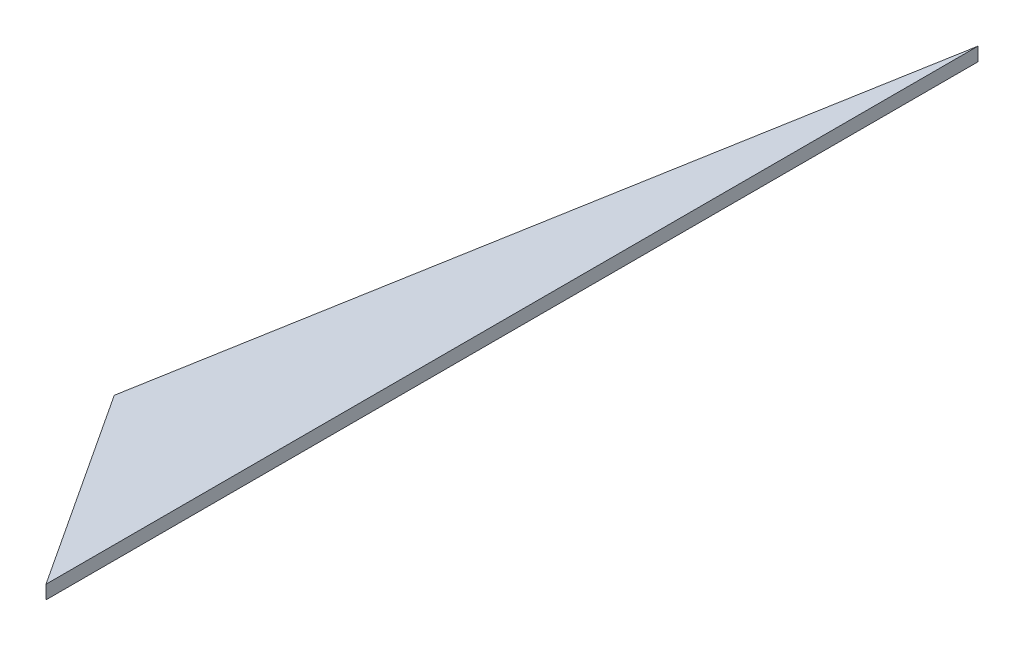
ISO-10303-21;
HEADER;
FILE_DESCRIPTION(('STEP AP214'),'2;1');
FILE_NAME('part.step','',(''),(''),'','','');
FILE_SCHEMA(('AUTOMOTIVE_DESIGN { 1 0 10303 214 1 1 1 1 }'));
ENDSEC;
DATA;
#1=APPLICATION_CONTEXT('core data for automotive mechanical design processes');
#2=APPLICATION_PROTOCOL_DEFINITION('international standard','automotive_design',2000,#1);
#3=PRODUCT_CONTEXT('',#1,'mechanical');
#4=PRODUCT('Part','Part','',(#3));
#5=PRODUCT_RELATED_PRODUCT_CATEGORY('part','',(#4));
#6=PRODUCT_DEFINITION_FORMATION('','',#4);
#7=PRODUCT_DEFINITION_CONTEXT('part definition',#1,'design');
#8=PRODUCT_DEFINITION('design','',#6,#7);
#9=PRODUCT_DEFINITION_SHAPE('','',#8);
#10=(LENGTH_UNIT() NAMED_UNIT(*) SI_UNIT(.MILLI.,.METRE.));
#11=(NAMED_UNIT(*) PLANE_ANGLE_UNIT() SI_UNIT($,.RADIAN.));
#12=(NAMED_UNIT(*) SI_UNIT($,.STERADIAN.) SOLID_ANGLE_UNIT());
#13=UNCERTAINTY_MEASURE_WITH_UNIT(LENGTH_MEASURE(1.E-05),#10,'distance_accuracy_value','');
#14=(GEOMETRIC_REPRESENTATION_CONTEXT(3) GLOBAL_UNCERTAINTY_ASSIGNED_CONTEXT((#13)) GLOBAL_UNIT_ASSIGNED_CONTEXT((#10,
#11,#12)) REPRESENTATION_CONTEXT('',''));
#15=CARTESIAN_POINT('',(0.,0.,0.));
#16=DIRECTION('',(0.,0.,1.));
#17=DIRECTION('',(1.,0.,0.));
#18=AXIS2_PLACEMENT_3D('',#15,#16,#17);
#19=CARTESIAN_POINT('',(-846.847432846052,88.9,-1293.28955011006));
#20=DIRECTION('',(0.836603496854691,0.,-0.54780889829438));
#21=DIRECTION('',(-0.54780889829438,0.,-0.836603496854691));
#22=AXIS2_PLACEMENT_3D('',#19,#20,#21);
#23=PLANE('',#22);
#24=DIRECTION('',(0.54780889829438,0.,0.836603496854691));
#25=VECTOR('',#24,1.);
#26=CARTESIAN_POINT('',(-846.847432846052,0.,-1293.28955011006));
#27=LINE('',#26,#25);
#28=CARTESIAN_POINT('',(-846.847432846052,0.,-1293.28955011006));
#29=VERTEX_POINT('',#28);
#30=CARTESIAN_POINT('',(0.,0.,0.));
#31=VERTEX_POINT('',#30);
#32=EDGE_CURVE('E89',#29,#31,#27,.T.);
#33=ORIENTED_EDGE('',*,*,#32,.T.);
#34=DIRECTION('',(0.,-1.,0.));
#35=VECTOR('',#34,1.);
#36=CARTESIAN_POINT('',(0.,88.9,0.));
#37=LINE('',#36,#35);
#38=CARTESIAN_POINT('',(0.,88.9,0.));
#39=VERTEX_POINT('',#38);
#40=EDGE_CURVE('E11',#39,#31,#37,.T.);
#41=ORIENTED_EDGE('',*,*,#40,.F.);
#42=DIRECTION('',(0.54780889829438,0.,0.836603496854691));
#43=VECTOR('',#42,1.);
#44=CARTESIAN_POINT('',(-846.847432846052,88.9,-1293.28955011006));
#45=LINE('',#44,#43);
#46=CARTESIAN_POINT('',(-846.847432846052,88.9,-1293.28955011006));
#47=VERTEX_POINT('',#46);
#48=EDGE_CURVE('E81',#47,#39,#45,.T.);
#49=ORIENTED_EDGE('',*,*,#48,.F.);
#50=DIRECTION('',(0.,-1.,0.));
#51=VECTOR('',#50,1.);
#52=CARTESIAN_POINT('',(-846.847432846052,88.9,-1293.28955011006));
#53=LINE('',#52,#51);
#54=EDGE_CURVE('E90',#47,#29,#53,.T.);
#55=ORIENTED_EDGE('',*,*,#54,.T.);
#56=EDGE_LOOP('',(#33,#41,#49,#55));
#57=FACE_BOUND('',#56,.T.);
#58=ADVANCED_FACE('F39',(#57),#23,.F.);
#59=CARTESIAN_POINT('',(0.,88.9,0.));
#60=DIRECTION('',(-1.,0.,0.));
#61=DIRECTION('',(0.,0.,1.));
#62=AXIS2_PLACEMENT_3D('',#59,#60,#61);
#63=PLANE('',#62);
#64=DIRECTION('',(0.,0.,-1.));
#65=VECTOR('',#64,1.);
#66=CARTESIAN_POINT('',(0.,0.,0.));
#67=LINE('',#66,#65);
#68=CARTESIAN_POINT('',(0.,0.,-6096.));
#69=VERTEX_POINT('',#68);
#70=EDGE_CURVE('E68',#31,#69,#67,.T.);
#71=ORIENTED_EDGE('',*,*,#70,.T.);
#72=DIRECTION('',(0.,-1.,0.));
#73=VECTOR('',#72,1.);
#74=CARTESIAN_POINT('',(0.,88.9,-6096.));
#75=LINE('',#74,#73);
#76=CARTESIAN_POINT('',(0.,88.9,-6096.));
#77=VERTEX_POINT('',#76);
#78=EDGE_CURVE('E48',#77,#69,#75,.T.);
#79=ORIENTED_EDGE('',*,*,#78,.F.);
#80=DIRECTION('',(0.,0.,-1.));
#81=VECTOR('',#80,1.);
#82=CARTESIAN_POINT('',(0.,88.9,0.));
#83=LINE('',#82,#81);
#84=EDGE_CURVE('E76',#39,#77,#83,.T.);
#85=ORIENTED_EDGE('',*,*,#84,.F.);
#86=ORIENTED_EDGE('',*,*,#40,.T.);
#87=EDGE_LOOP('',(#71,#79,#85,#86));
#88=FACE_BOUND('',#87,.T.);
#89=ADVANCED_FACE('F77',(#88),#63,.F.);
#90=CARTESIAN_POINT('',(0.,88.9,-6096.));
#91=DIRECTION('',(0.984807753012209,0.,0.173648177666923));
#92=DIRECTION('',(0.173648177666923,0.,-0.984807753012209));
#93=AXIS2_PLACEMENT_3D('',#90,#91,#92);
#94=PLANE('',#93);
#95=DIRECTION('',(-0.173648177666923,0.,0.984807753012209));
#96=VECTOR('',#95,1.);
#97=CARTESIAN_POINT('',(0.,0.,-6096.));
#98=LINE('',#97,#96);
#99=EDGE_CURVE('E73',#69,#29,#98,.T.);
#100=ORIENTED_EDGE('',*,*,#99,.T.);
#101=ORIENTED_EDGE('',*,*,#54,.F.);
#102=DIRECTION('',(-0.173648177666923,0.,0.984807753012209));
#103=VECTOR('',#102,1.);
#104=CARTESIAN_POINT('',(0.,88.9,-6096.));
#105=LINE('',#104,#103);
#106=EDGE_CURVE('E56',#77,#47,#105,.T.);
#107=ORIENTED_EDGE('',*,*,#106,.F.);
#108=ORIENTED_EDGE('',*,*,#78,.T.);
#109=EDGE_LOOP('',(#100,#101,#107,#108));
#110=FACE_BOUND('',#109,.T.);
#111=ADVANCED_FACE('F102',(#110),#94,.F.);
#112=CARTESIAN_POINT('',(0.,88.9,0.));
#113=DIRECTION('',(0.,-1.,0.));
#114=DIRECTION('',(0.,0.,-1.));
#115=AXIS2_PLACEMENT_3D('',#112,#113,#114);
#116=PLANE('',#115);
#117=ORIENTED_EDGE('',*,*,#48,.T.);
#118=ORIENTED_EDGE('',*,*,#84,.T.);
#119=ORIENTED_EDGE('',*,*,#106,.T.);
#120=EDGE_LOOP('',(#117,#118,#119));
#121=FACE_BOUND('',#120,.T.);
#122=ADVANCED_FACE('F84',(#121),#116,.F.);
#123=CARTESIAN_POINT('',(0.,0.,0.));
#124=DIRECTION('',(0.,-1.,0.));
#125=DIRECTION('',(0.,0.,-1.));
#126=AXIS2_PLACEMENT_3D('',#123,#124,#125);
#127=PLANE('',#126);
#128=ORIENTED_EDGE('',*,*,#32,.F.);
#129=ORIENTED_EDGE('',*,*,#99,.F.);
#130=ORIENTED_EDGE('',*,*,#70,.F.);
#131=EDGE_LOOP('',(#128,#129,#130));
#132=FACE_BOUND('',#131,.T.);
#133=ADVANCED_FACE('F103',(#132),#127,.T.);
#134=CLOSED_SHELL('',(#58,#89,#111,#122,#133));
#135=MANIFOLD_SOLID_BREP('B2',#134);
#136=ADVANCED_BREP_SHAPE_REPRESENTATION('',(#18,#135),#14);
#137=SHAPE_DEFINITION_REPRESENTATION(#9,#136);
ENDSEC;
END-ISO-10303-21;
